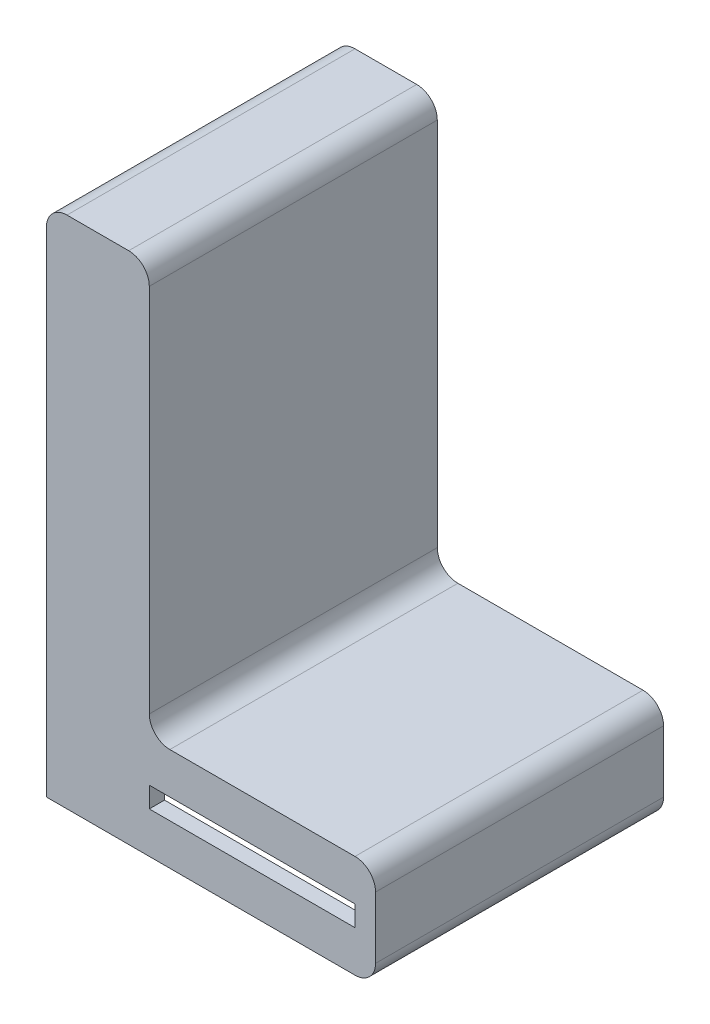
ISO-10303-21;
HEADER;
FILE_DESCRIPTION(('STEP AP214'),'2;1');
FILE_NAME('part.step','',(''),(''),'','','');
FILE_SCHEMA(('AUTOMOTIVE_DESIGN { 1 0 10303 214 1 1 1 1 }'));
ENDSEC;
DATA;
#1=APPLICATION_CONTEXT('core data for automotive mechanical design processes');
#2=APPLICATION_PROTOCOL_DEFINITION('international standard','automotive_design',2000,#1);
#3=PRODUCT_CONTEXT('',#1,'mechanical');
#4=PRODUCT('Part','Part','',(#3));
#5=PRODUCT_RELATED_PRODUCT_CATEGORY('part','',(#4));
#6=PRODUCT_DEFINITION_FORMATION('','',#4);
#7=PRODUCT_DEFINITION_CONTEXT('part definition',#1,'design');
#8=PRODUCT_DEFINITION('design','',#6,#7);
#9=PRODUCT_DEFINITION_SHAPE('','',#8);
#10=(LENGTH_UNIT() NAMED_UNIT(*) SI_UNIT(.MILLI.,.METRE.));
#11=(NAMED_UNIT(*) PLANE_ANGLE_UNIT() SI_UNIT($,.RADIAN.));
#12=(NAMED_UNIT(*) SI_UNIT($,.STERADIAN.) SOLID_ANGLE_UNIT());
#13=UNCERTAINTY_MEASURE_WITH_UNIT(LENGTH_MEASURE(1.E-05),#10,'distance_accuracy_value','');
#14=(GEOMETRIC_REPRESENTATION_CONTEXT(3) GLOBAL_UNCERTAINTY_ASSIGNED_CONTEXT((#13)) GLOBAL_UNIT_ASSIGNED_CONTEXT((#10,
#11,#12)) REPRESENTATION_CONTEXT('',''));
#15=CARTESIAN_POINT('',(0.,0.,0.));
#16=DIRECTION('',(0.,0.,1.));
#17=DIRECTION('',(1.,0.,0.));
#18=AXIS2_PLACEMENT_3D('',#15,#16,#17);
#19=CARTESIAN_POINT('',(0.,0.,14.));
#20=DIRECTION('',(0.,1.,0.));
#21=DIRECTION('',(0.,0.,1.));
#22=AXIS2_PLACEMENT_3D('',#19,#20,#21);
#23=PLANE('',#22);
#24=DIRECTION('',(1.,0.,0.));
#25=VECTOR('',#24,1.);
#26=CARTESIAN_POINT('',(0.683289673684551,0.,0.471103780602268));
#27=LINE('',#26,#25);
#28=CARTESIAN_POINT('',(0.683289673684551,0.,0.471103780602267));
#29=VERTEX_POINT('',#28);
#30=CARTESIAN_POINT('',(14.6647262378319,0.,0.471103780602268));
#31=VERTEX_POINT('',#30);
#32=EDGE_CURVE('E347',#29,#31,#27,.T.);
#33=ORIENTED_EDGE('',*,*,#32,.F.);
#34=DIRECTION('',(0.,0.,-1.));
#35=VECTOR('',#34,1.);
#36=CARTESIAN_POINT('',(0.683289673684551,0.,13.2572361825298));
#37=LINE('',#36,#35);
#38=CARTESIAN_POINT('',(0.683289673684551,0.,13.2572361825298));
#39=VERTEX_POINT('',#38);
#40=EDGE_CURVE('E326',#39,#29,#37,.T.);
#41=ORIENTED_EDGE('',*,*,#40,.F.);
#42=DIRECTION('',(-1.,0.,0.));
#43=VECTOR('',#42,1.);
#44=CARTESIAN_POINT('',(0.683289673684551,0.,13.2572361825298));
#45=LINE('',#44,#43);
#46=CARTESIAN_POINT('',(14.6647262378319,0.,13.2572361825298));
#47=VERTEX_POINT('',#46);
#48=EDGE_CURVE('E332',#47,#39,#45,.T.);
#49=ORIENTED_EDGE('',*,*,#48,.F.);
#50=DIRECTION('',(0.,0.,1.));
#51=VECTOR('',#50,1.);
#52=CARTESIAN_POINT('',(14.6647262378319,0.,13.2572361825298));
#53=LINE('',#52,#51);
#54=EDGE_CURVE('E351',#31,#47,#53,.T.);
#55=ORIENTED_EDGE('',*,*,#54,.F.);
#56=EDGE_LOOP('',(#33,#41,#49,#55));
#57=FACE_BOUND('',#56,.T.);
#58=DIRECTION('',(1.,0.,0.));
#59=VECTOR('',#58,1.);
#60=CARTESIAN_POINT('',(0.,0.,0.));
#61=LINE('',#60,#59);
#62=CARTESIAN_POINT('',(0.,0.,0.));
#63=VERTEX_POINT('',#62);
#64=CARTESIAN_POINT('',(15.,0.,0.));
#65=VERTEX_POINT('',#64);
#66=EDGE_CURVE('E361',#63,#65,#61,.T.);
#67=ORIENTED_EDGE('',*,*,#66,.T.);
#68=DIRECTION('',(0.,0.,-1.));
#69=VECTOR('',#68,1.);
#70=CARTESIAN_POINT('',(15.,0.,14.));
#71=LINE('',#70,#69);
#72=CARTESIAN_POINT('',(15.,0.,14.));
#73=VERTEX_POINT('',#72);
#74=EDGE_CURVE('E482',#73,#65,#71,.T.);
#75=ORIENTED_EDGE('',*,*,#74,.F.);
#76=DIRECTION('',(1.,0.,0.));
#77=VECTOR('',#76,1.);
#78=CARTESIAN_POINT('',(0.,0.,14.));
#79=LINE('',#78,#77);
#80=CARTESIAN_POINT('',(0.,0.,14.));
#81=VERTEX_POINT('',#80);
#82=EDGE_CURVE('E375',#81,#73,#79,.T.);
#83=ORIENTED_EDGE('',*,*,#82,.F.);
#84=DIRECTION('',(0.,0.,-1.));
#85=VECTOR('',#84,1.);
#86=CARTESIAN_POINT('',(0.,0.,14.));
#87=LINE('',#86,#85);
#88=EDGE_CURVE('E410',#81,#63,#87,.T.);
#89=ORIENTED_EDGE('',*,*,#88,.T.);
#90=EDGE_LOOP('',(#67,#75,#83,#89));
#91=FACE_BOUND('',#90,.T.);
#92=ADVANCED_FACE('F45',(#57,#91),#23,.F.);
#93=CARTESIAN_POINT('',(15.,1.,14.));
#94=DIRECTION('',(0.,0.,-1.));
#95=DIRECTION('',(-1.,0.,0.));
#96=AXIS2_PLACEMENT_3D('',#93,#94,#95);
#97=CYLINDRICAL_SURFACE('',#96,1.);
#98=CARTESIAN_POINT('',(15.,1.,0.));
#99=DIRECTION('',(0.,0.,1.));
#100=DIRECTION('',(1.,0.,0.));
#101=AXIS2_PLACEMENT_3D('',#98,#99,#100);
#102=CIRCLE('',#101,1.);
#103=CARTESIAN_POINT('',(16.,1.00000000000001,0.));
#104=VERTEX_POINT('',#103);
#105=EDGE_CURVE('E414',#65,#104,#102,.T.);
#106=ORIENTED_EDGE('',*,*,#105,.T.);
#107=DIRECTION('',(0.,0.,-1.));
#108=VECTOR('',#107,1.);
#109=CARTESIAN_POINT('',(16.,1.00000000000001,14.));
#110=LINE('',#109,#108);
#111=CARTESIAN_POINT('',(16.,1.00000000000001,14.));
#112=VERTEX_POINT('',#111);
#113=EDGE_CURVE('E478',#112,#104,#110,.T.);
#114=ORIENTED_EDGE('',*,*,#113,.F.);
#115=CARTESIAN_POINT('',(15.,1.,14.));
#116=DIRECTION('',(0.,0.,1.));
#117=DIRECTION('',(1.,0.,0.));
#118=AXIS2_PLACEMENT_3D('',#115,#116,#117);
#119=CIRCLE('',#118,1.);
#120=EDGE_CURVE('E379',#73,#112,#119,.T.);
#121=ORIENTED_EDGE('',*,*,#120,.F.);
#122=ORIENTED_EDGE('',*,*,#74,.T.);
#123=EDGE_LOOP('',(#106,#114,#121,#122));
#124=FACE_BOUND('',#123,.T.);
#125=ADVANCED_FACE('F565',(#124),#97,.T.);
#126=CARTESIAN_POINT('',(16.,3.99999999999999,14.));
#127=DIRECTION('',(-1.,0.,0.));
#128=DIRECTION('',(0.,0.,1.));
#129=AXIS2_PLACEMENT_3D('',#126,#127,#128);
#130=PLANE('',#129);
#131=DIRECTION('',(0.,1.,0.));
#132=VECTOR('',#131,1.);
#133=CARTESIAN_POINT('',(16.,3.99999999999999,0.));
#134=LINE('',#133,#132);
#135=CARTESIAN_POINT('',(16.,3.99999999999999,0.));
#136=VERTEX_POINT('',#135);
#137=EDGE_CURVE('E417',#104,#136,#134,.T.);
#138=ORIENTED_EDGE('',*,*,#137,.T.);
#139=DIRECTION('',(0.,0.,-1.));
#140=VECTOR('',#139,1.);
#141=CARTESIAN_POINT('',(16.,3.99999999999999,14.));
#142=LINE('',#141,#140);
#143=CARTESIAN_POINT('',(16.,3.99999999999999,14.));
#144=VERTEX_POINT('',#143);
#145=EDGE_CURVE('E474',#144,#136,#142,.T.);
#146=ORIENTED_EDGE('',*,*,#145,.F.);
#147=DIRECTION('',(0.,1.,0.));
#148=VECTOR('',#147,1.);
#149=CARTESIAN_POINT('',(16.,3.99999999999999,14.));
#150=LINE('',#149,#148);
#151=EDGE_CURVE('E383',#112,#144,#150,.T.);
#152=ORIENTED_EDGE('',*,*,#151,.F.);
#153=ORIENTED_EDGE('',*,*,#113,.T.);
#154=EDGE_LOOP('',(#138,#146,#152,#153));
#155=FACE_BOUND('',#154,.T.);
#156=ADVANCED_FACE('F569',(#155),#130,.F.);
#157=CARTESIAN_POINT('',(15.,4.,14.));
#158=DIRECTION('',(0.,0.,-1.));
#159=DIRECTION('',(-1.,0.,0.));
#160=AXIS2_PLACEMENT_3D('',#157,#158,#159);
#161=CYLINDRICAL_SURFACE('',#160,1.);
#162=CARTESIAN_POINT('',(15.,4.,0.));
#163=DIRECTION('',(0.,0.,1.));
#164=DIRECTION('',(-1.,0.,0.));
#165=AXIS2_PLACEMENT_3D('',#162,#163,#164);
#166=CIRCLE('',#165,1.);
#167=CARTESIAN_POINT('',(15.,5.,0.));
#168=VERTEX_POINT('',#167);
#169=EDGE_CURVE('E420',#136,#168,#166,.T.);
#170=ORIENTED_EDGE('',*,*,#169,.T.);
#171=DIRECTION('',(0.,0.,-1.));
#172=VECTOR('',#171,1.);
#173=CARTESIAN_POINT('',(15.,5.,14.));
#174=LINE('',#173,#172);
#175=CARTESIAN_POINT('',(15.,5.,14.));
#176=VERTEX_POINT('',#175);
#177=EDGE_CURVE('E470',#176,#168,#174,.T.);
#178=ORIENTED_EDGE('',*,*,#177,.F.);
#179=CARTESIAN_POINT('',(15.,4.,14.));
#180=DIRECTION('',(0.,0.,1.));
#181=DIRECTION('',(-1.,0.,0.));
#182=AXIS2_PLACEMENT_3D('',#179,#180,#181);
#183=CIRCLE('',#182,1.);
#184=EDGE_CURVE('E386',#144,#176,#183,.T.);
#185=ORIENTED_EDGE('',*,*,#184,.F.);
#186=ORIENTED_EDGE('',*,*,#145,.T.);
#187=EDGE_LOOP('',(#170,#178,#185,#186));
#188=FACE_BOUND('',#187,.T.);
#189=ADVANCED_FACE('F574',(#188),#161,.T.);
#190=CARTESIAN_POINT('',(6.00000000000001,5.,14.));
#191=DIRECTION('',(0.,-1.,0.));
#192=DIRECTION('',(0.,0.,-1.));
#193=AXIS2_PLACEMENT_3D('',#190,#191,#192);
#194=PLANE('',#193);
#195=DIRECTION('',(-1.,0.,0.));
#196=VECTOR('',#195,1.);
#197=CARTESIAN_POINT('',(6.00000000000001,5.,0.));
#198=LINE('',#197,#196);
#199=CARTESIAN_POINT('',(6.00000000000001,5.,0.));
#200=VERTEX_POINT('',#199);
#201=EDGE_CURVE('E423',#168,#200,#198,.T.);
#202=ORIENTED_EDGE('',*,*,#201,.T.);
#203=DIRECTION('',(0.,0.,-1.));
#204=VECTOR('',#203,1.);
#205=CARTESIAN_POINT('',(6.00000000000001,5.,14.));
#206=LINE('',#205,#204);
#207=CARTESIAN_POINT('',(6.00000000000001,5.,14.));
#208=VERTEX_POINT('',#207);
#209=EDGE_CURVE('E466',#208,#200,#206,.T.);
#210=ORIENTED_EDGE('',*,*,#209,.F.);
#211=DIRECTION('',(-1.,0.,0.));
#212=VECTOR('',#211,1.);
#213=CARTESIAN_POINT('',(6.00000000000001,5.,14.));
#214=LINE('',#213,#212);
#215=EDGE_CURVE('E389',#176,#208,#214,.T.);
#216=ORIENTED_EDGE('',*,*,#215,.F.);
#217=ORIENTED_EDGE('',*,*,#177,.T.);
#218=EDGE_LOOP('',(#202,#210,#216,#217));
#219=FACE_BOUND('',#218,.T.);
#220=ADVANCED_FACE('F580',(#219),#194,.F.);
#221=CARTESIAN_POINT('',(6.,6.,14.));
#222=DIRECTION('',(0.,0.,-1.));
#223=DIRECTION('',(-1.,0.,0.));
#224=AXIS2_PLACEMENT_3D('',#221,#222,#223);
#225=CYLINDRICAL_SURFACE('',#224,1.);
#226=CARTESIAN_POINT('',(6.,6.,0.));
#227=DIRECTION('',(0.,0.,-1.));
#228=DIRECTION('',(1.,0.,0.));
#229=AXIS2_PLACEMENT_3D('',#226,#227,#228);
#230=CIRCLE('',#229,1.);
#231=CARTESIAN_POINT('',(5.,6.00000000000001,0.));
#232=VERTEX_POINT('',#231);
#233=EDGE_CURVE('E426',#200,#232,#230,.T.);
#234=ORIENTED_EDGE('',*,*,#233,.T.);
#235=DIRECTION('',(0.,0.,-1.));
#236=VECTOR('',#235,1.);
#237=CARTESIAN_POINT('',(5.,6.00000000000001,14.));
#238=LINE('',#237,#236);
#239=CARTESIAN_POINT('',(5.,6.00000000000001,14.));
#240=VERTEX_POINT('',#239);
#241=EDGE_CURVE('E462',#240,#232,#238,.T.);
#242=ORIENTED_EDGE('',*,*,#241,.F.);
#243=CARTESIAN_POINT('',(6.,6.,14.));
#244=DIRECTION('',(0.,0.,-1.));
#245=DIRECTION('',(1.,0.,0.));
#246=AXIS2_PLACEMENT_3D('',#243,#244,#245);
#247=CIRCLE('',#246,1.);
#248=EDGE_CURVE('E392',#208,#240,#247,.T.);
#249=ORIENTED_EDGE('',*,*,#248,.F.);
#250=ORIENTED_EDGE('',*,*,#209,.T.);
#251=EDGE_LOOP('',(#234,#242,#249,#250));
#252=FACE_BOUND('',#251,.T.);
#253=ADVANCED_FACE('F584',(#252),#225,.F.);
#254=CARTESIAN_POINT('',(5.,24.,14.));
#255=DIRECTION('',(-1.,0.,0.));
#256=DIRECTION('',(0.,0.,1.));
#257=AXIS2_PLACEMENT_3D('',#254,#255,#256);
#258=PLANE('',#257);
#259=DIRECTION('',(0.,1.,0.));
#260=VECTOR('',#259,1.);
#261=CARTESIAN_POINT('',(5.,24.,0.));
#262=LINE('',#261,#260);
#263=CARTESIAN_POINT('',(5.,24.,0.));
#264=VERTEX_POINT('',#263);
#265=EDGE_CURVE('E429',#232,#264,#262,.T.);
#266=ORIENTED_EDGE('',*,*,#265,.T.);
#267=DIRECTION('',(0.,0.,-1.));
#268=VECTOR('',#267,1.);
#269=CARTESIAN_POINT('',(5.,24.,14.));
#270=LINE('',#269,#268);
#271=CARTESIAN_POINT('',(5.,24.,14.));
#272=VERTEX_POINT('',#271);
#273=EDGE_CURVE('E458',#272,#264,#270,.T.);
#274=ORIENTED_EDGE('',*,*,#273,.F.);
#275=DIRECTION('',(0.,1.,0.));
#276=VECTOR('',#275,1.);
#277=CARTESIAN_POINT('',(5.,24.,14.));
#278=LINE('',#277,#276);
#279=EDGE_CURVE('E395',#240,#272,#278,.T.);
#280=ORIENTED_EDGE('',*,*,#279,.F.);
#281=ORIENTED_EDGE('',*,*,#241,.T.);
#282=EDGE_LOOP('',(#266,#274,#280,#281));
#283=FACE_BOUND('',#282,.T.);
#284=ADVANCED_FACE('F588',(#283),#258,.F.);
#285=CARTESIAN_POINT('',(4.,24.,14.));
#286=DIRECTION('',(0.,0.,-1.));
#287=DIRECTION('',(-1.,0.,0.));
#288=AXIS2_PLACEMENT_3D('',#285,#286,#287);
#289=CYLINDRICAL_SURFACE('',#288,1.);
#290=CARTESIAN_POINT('',(4.,24.,0.));
#291=DIRECTION('',(0.,0.,1.));
#292=DIRECTION('',(1.,0.,0.));
#293=AXIS2_PLACEMENT_3D('',#290,#291,#292);
#294=CIRCLE('',#293,1.);
#295=CARTESIAN_POINT('',(3.99999999999999,25.,0.));
#296=VERTEX_POINT('',#295);
#297=EDGE_CURVE('E432',#264,#296,#294,.T.);
#298=ORIENTED_EDGE('',*,*,#297,.T.);
#299=DIRECTION('',(0.,0.,-1.));
#300=VECTOR('',#299,1.);
#301=CARTESIAN_POINT('',(3.99999999999999,25.,14.));
#302=LINE('',#301,#300);
#303=CARTESIAN_POINT('',(3.99999999999999,25.,14.));
#304=VERTEX_POINT('',#303);
#305=EDGE_CURVE('E454',#304,#296,#302,.T.);
#306=ORIENTED_EDGE('',*,*,#305,.F.);
#307=CARTESIAN_POINT('',(4.,24.,14.));
#308=DIRECTION('',(0.,0.,1.));
#309=DIRECTION('',(1.,0.,0.));
#310=AXIS2_PLACEMENT_3D('',#307,#308,#309);
#311=CIRCLE('',#310,1.);
#312=EDGE_CURVE('E398',#272,#304,#311,.T.);
#313=ORIENTED_EDGE('',*,*,#312,.F.);
#314=ORIENTED_EDGE('',*,*,#273,.T.);
#315=EDGE_LOOP('',(#298,#306,#313,#314));
#316=FACE_BOUND('',#315,.T.);
#317=ADVANCED_FACE('F592',(#316),#289,.T.);
#318=CARTESIAN_POINT('',(1.00000000000001,25.,14.));
#319=DIRECTION('',(0.,-1.,0.));
#320=DIRECTION('',(0.,0.,-1.));
#321=AXIS2_PLACEMENT_3D('',#318,#319,#320);
#322=PLANE('',#321);
#323=DIRECTION('',(-1.,0.,0.));
#324=VECTOR('',#323,1.);
#325=CARTESIAN_POINT('',(1.00000000000001,25.,0.));
#326=LINE('',#325,#324);
#327=CARTESIAN_POINT('',(1.00000000000001,25.,0.));
#328=VERTEX_POINT('',#327);
#329=EDGE_CURVE('E435',#296,#328,#326,.T.);
#330=ORIENTED_EDGE('',*,*,#329,.T.);
#331=DIRECTION('',(0.,0.,-1.));
#332=VECTOR('',#331,1.);
#333=CARTESIAN_POINT('',(1.00000000000001,25.,14.));
#334=LINE('',#333,#332);
#335=CARTESIAN_POINT('',(1.00000000000001,25.,14.));
#336=VERTEX_POINT('',#335);
#337=EDGE_CURVE('E450',#336,#328,#334,.T.);
#338=ORIENTED_EDGE('',*,*,#337,.F.);
#339=DIRECTION('',(-1.,0.,0.));
#340=VECTOR('',#339,1.);
#341=CARTESIAN_POINT('',(1.00000000000001,25.,14.));
#342=LINE('',#341,#340);
#343=EDGE_CURVE('E401',#304,#336,#342,.T.);
#344=ORIENTED_EDGE('',*,*,#343,.F.);
#345=ORIENTED_EDGE('',*,*,#305,.T.);
#346=EDGE_LOOP('',(#330,#338,#344,#345));
#347=FACE_BOUND('',#346,.T.);
#348=ADVANCED_FACE('F596',(#347),#322,.F.);
#349=CARTESIAN_POINT('',(1.,24.,14.));
#350=DIRECTION('',(0.,0.,-1.));
#351=DIRECTION('',(-1.,0.,0.));
#352=AXIS2_PLACEMENT_3D('',#349,#350,#351);
#353=CYLINDRICAL_SURFACE('',#352,1.);
#354=CARTESIAN_POINT('',(1.,24.,0.));
#355=DIRECTION('',(0.,0.,1.));
#356=DIRECTION('',(-1.,0.,0.));
#357=AXIS2_PLACEMENT_3D('',#354,#355,#356);
#358=CIRCLE('',#357,1.);
#359=CARTESIAN_POINT('',(0.,24.,0.));
#360=VERTEX_POINT('',#359);
#361=EDGE_CURVE('E438',#328,#360,#358,.T.);
#362=ORIENTED_EDGE('',*,*,#361,.T.);
#363=DIRECTION('',(0.,0.,-1.));
#364=VECTOR('',#363,1.);
#365=CARTESIAN_POINT('',(0.,24.,14.));
#366=LINE('',#365,#364);
#367=CARTESIAN_POINT('',(0.,24.,14.));
#368=VERTEX_POINT('',#367);
#369=EDGE_CURVE('E446',#368,#360,#366,.T.);
#370=ORIENTED_EDGE('',*,*,#369,.F.);
#371=CARTESIAN_POINT('',(1.,24.,14.));
#372=DIRECTION('',(0.,0.,1.));
#373=DIRECTION('',(-1.,0.,0.));
#374=AXIS2_PLACEMENT_3D('',#371,#372,#373);
#375=CIRCLE('',#374,1.);
#376=EDGE_CURVE('E404',#336,#368,#375,.T.);
#377=ORIENTED_EDGE('',*,*,#376,.F.);
#378=ORIENTED_EDGE('',*,*,#337,.T.);
#379=EDGE_LOOP('',(#362,#370,#377,#378));
#380=FACE_BOUND('',#379,.T.);
#381=ADVANCED_FACE('F600',(#380),#353,.T.);
#382=CARTESIAN_POINT('',(0.,24.,14.));
#383=DIRECTION('',(1.,0.,0.));
#384=DIRECTION('',(0.,1.,0.));
#385=AXIS2_PLACEMENT_3D('',#382,#383,#384);
#386=PLANE('',#385);
#387=DIRECTION('',(0.,-1.,0.));
#388=VECTOR('',#387,1.);
#389=CARTESIAN_POINT('',(0.,24.,0.));
#390=LINE('',#389,#388);
#391=EDGE_CURVE('E380',#360,#63,#390,.T.);
#392=ORIENTED_EDGE('',*,*,#391,.T.);
#393=ORIENTED_EDGE('',*,*,#88,.F.);
#394=DIRECTION('',(0.,-1.,0.));
#395=VECTOR('',#394,1.);
#396=CARTESIAN_POINT('',(0.,24.,14.));
#397=LINE('',#396,#395);
#398=EDGE_CURVE('E407',#368,#81,#397,.T.);
#399=ORIENTED_EDGE('',*,*,#398,.F.);
#400=ORIENTED_EDGE('',*,*,#369,.T.);
#401=EDGE_LOOP('',(#392,#393,#399,#400));
#402=FACE_BOUND('',#401,.T.);
#403=ADVANCED_FACE('F604',(#402),#386,.F.);
#404=CARTESIAN_POINT('',(15.,1.,14.));
#405=DIRECTION('',(0.,0.,1.));
#406=DIRECTION('',(1.,0.,0.));
#407=AXIS2_PLACEMENT_3D('',#404,#405,#406);
#408=PLANE('',#407);
#409=DIRECTION('',(0.,-1.,0.));
#410=VECTOR('',#409,1.);
#411=CARTESIAN_POINT('',(5.,3.,14.));
#412=LINE('',#411,#410);
#413=CARTESIAN_POINT('',(5.,3.,14.));
#414=VERTEX_POINT('',#413);
#415=CARTESIAN_POINT('',(5.,2.,14.));
#416=VERTEX_POINT('',#415);
#417=EDGE_CURVE('E68',#414,#416,#412,.T.);
#418=ORIENTED_EDGE('',*,*,#417,.F.);
#419=DIRECTION('',(-1.,0.,0.));
#420=VECTOR('',#419,1.);
#421=CARTESIAN_POINT('',(5.,3.,14.));
#422=LINE('',#421,#420);
#423=CARTESIAN_POINT('',(15.,3.,14.));
#424=VERTEX_POINT('',#423);
#425=EDGE_CURVE('E286',#424,#414,#422,.T.);
#426=ORIENTED_EDGE('',*,*,#425,.F.);
#427=DIRECTION('',(0.,1.,0.));
#428=VECTOR('',#427,1.);
#429=CARTESIAN_POINT('',(15.,3.,14.));
#430=LINE('',#429,#428);
#431=CARTESIAN_POINT('',(15.,2.,14.));
#432=VERTEX_POINT('',#431);
#433=EDGE_CURVE('E300',#432,#424,#430,.T.);
#434=ORIENTED_EDGE('',*,*,#433,.F.);
#435=DIRECTION('',(1.,0.,0.));
#436=VECTOR('',#435,1.);
#437=CARTESIAN_POINT('',(5.,2.,14.));
#438=LINE('',#437,#436);
#439=EDGE_CURVE('E296',#416,#432,#438,.T.);
#440=ORIENTED_EDGE('',*,*,#439,.F.);
#441=EDGE_LOOP('',(#418,#426,#434,#440));
#442=FACE_BOUND('',#441,.T.);
#443=ORIENTED_EDGE('',*,*,#82,.T.);
#444=ORIENTED_EDGE('',*,*,#120,.T.);
#445=ORIENTED_EDGE('',*,*,#151,.T.);
#446=ORIENTED_EDGE('',*,*,#184,.T.);
#447=ORIENTED_EDGE('',*,*,#215,.T.);
#448=ORIENTED_EDGE('',*,*,#248,.T.);
#449=ORIENTED_EDGE('',*,*,#279,.T.);
#450=ORIENTED_EDGE('',*,*,#312,.T.);
#451=ORIENTED_EDGE('',*,*,#343,.T.);
#452=ORIENTED_EDGE('',*,*,#376,.T.);
#453=ORIENTED_EDGE('',*,*,#398,.T.);
#454=EDGE_LOOP('',(#443,#444,#445,#446,#447,#448,#449,#450,#451,#452,#453));
#455=FACE_BOUND('',#454,.T.);
#456=ADVANCED_FACE('F560',(#442,#455),#408,.T.);
#457=CARTESIAN_POINT('',(15.,1.,0.));
#458=DIRECTION('',(0.,0.,1.));
#459=DIRECTION('',(1.,0.,0.));
#460=AXIS2_PLACEMENT_3D('',#457,#458,#459);
#461=PLANE('',#460);
#462=DIRECTION('',(1.,0.,0.));
#463=VECTOR('',#462,1.);
#464=CARTESIAN_POINT('',(15.,3.,0.));
#465=LINE('',#464,#463);
#466=CARTESIAN_POINT('',(5.05701626726173,3.,0.));
#467=VERTEX_POINT('',#466);
#468=CARTESIAN_POINT('',(15.,3.,0.));
#469=VERTEX_POINT('',#468);
#470=EDGE_CURVE('E234',#467,#469,#465,.T.);
#471=ORIENTED_EDGE('',*,*,#470,.F.);
#472=DIRECTION('',(0.,1.,0.));
#473=VECTOR('',#472,1.);
#474=CARTESIAN_POINT('',(5.05701626726173,3.,0.));
#475=LINE('',#474,#473);
#476=CARTESIAN_POINT('',(5.05701626726173,2.,0.));
#477=VERTEX_POINT('',#476);
#478=EDGE_CURVE('E241',#477,#467,#475,.T.);
#479=ORIENTED_EDGE('',*,*,#478,.F.);
#480=DIRECTION('',(-1.,0.,0.));
#481=VECTOR('',#480,1.);
#482=CARTESIAN_POINT('',(15.,2.,0.));
#483=LINE('',#482,#481);
#484=CARTESIAN_POINT('',(15.,2.,0.));
#485=VERTEX_POINT('',#484);
#486=EDGE_CURVE('E225',#485,#477,#483,.T.);
#487=ORIENTED_EDGE('',*,*,#486,.F.);
#488=DIRECTION('',(0.,-1.,0.));
#489=VECTOR('',#488,1.);
#490=CARTESIAN_POINT('',(15.,3.,0.));
#491=LINE('',#490,#489);
#492=EDGE_CURVE('E60',#469,#485,#491,.T.);
#493=ORIENTED_EDGE('',*,*,#492,.F.);
#494=EDGE_LOOP('',(#471,#479,#487,#493));
#495=FACE_BOUND('',#494,.T.);
#496=ORIENTED_EDGE('',*,*,#66,.F.);
#497=ORIENTED_EDGE('',*,*,#391,.F.);
#498=ORIENTED_EDGE('',*,*,#361,.F.);
#499=ORIENTED_EDGE('',*,*,#329,.F.);
#500=ORIENTED_EDGE('',*,*,#297,.F.);
#501=ORIENTED_EDGE('',*,*,#265,.F.);
#502=ORIENTED_EDGE('',*,*,#233,.F.);
#503=ORIENTED_EDGE('',*,*,#201,.F.);
#504=ORIENTED_EDGE('',*,*,#169,.F.);
#505=ORIENTED_EDGE('',*,*,#137,.F.);
#506=ORIENTED_EDGE('',*,*,#105,.F.);
#507=EDGE_LOOP('',(#496,#497,#498,#499,#500,#501,#502,#503,#504,#505,#506));
#508=FACE_BOUND('',#507,.T.);
#509=ADVANCED_FACE('F245',(#495,#508),#461,.F.);
#510=CARTESIAN_POINT('',(0.683289673684551,4.,13.2572361825298));
#511=DIRECTION('',(-1.,0.,0.));
#512=DIRECTION('',(0.,0.,1.));
#513=AXIS2_PLACEMENT_3D('',#510,#511,#512);
#514=PLANE('',#513);
#515=ORIENTED_EDGE('',*,*,#40,.T.);
#516=DIRECTION('',(0.,-1.,0.));
#517=VECTOR('',#516,1.);
#518=CARTESIAN_POINT('',(0.683289673684551,4.,0.471103780602268));
#519=LINE('',#518,#517);
#520=CARTESIAN_POINT('',(0.683289673684551,4.,0.471103780602268));
#521=VERTEX_POINT('',#520);
#522=EDGE_CURVE('E344',#521,#29,#519,.T.);
#523=ORIENTED_EDGE('',*,*,#522,.F.);
#524=DIRECTION('',(0.,0.,-1.));
#525=VECTOR('',#524,1.);
#526=CARTESIAN_POINT('',(0.683289673684551,4.,13.2572361825298));
#527=LINE('',#526,#525);
#528=CARTESIAN_POINT('',(0.683289673684551,4.,13.2572361825298));
#529=VERTEX_POINT('',#528);
#530=EDGE_CURVE('E327',#529,#521,#527,.T.);
#531=ORIENTED_EDGE('',*,*,#530,.F.);
#532=DIRECTION('',(0.,-1.,0.));
#533=VECTOR('',#532,1.);
#534=CARTESIAN_POINT('',(0.683289673684551,4.,13.2572361825298));
#535=LINE('',#534,#533);
#536=EDGE_CURVE('E358',#529,#39,#535,.T.);
#537=ORIENTED_EDGE('',*,*,#536,.T.);
#538=EDGE_LOOP('',(#515,#523,#531,#537));
#539=FACE_BOUND('',#538,.T.);
#540=ADVANCED_FACE('F552',(#539),#514,.F.);
#541=CARTESIAN_POINT('',(0.683289673684551,4.,13.2572361825298));
#542=DIRECTION('',(0.,0.,1.));
#543=DIRECTION('',(1.,0.,0.));
#544=AXIS2_PLACEMENT_3D('',#541,#542,#543);
#545=PLANE('',#544);
#546=DIRECTION('',(0.,-1.,0.));
#547=VECTOR('',#546,1.);
#548=CARTESIAN_POINT('',(14.6647262378319,4.,13.2572361825298));
#549=LINE('',#548,#547);
#550=CARTESIAN_POINT('',(14.6647262378319,4.,13.2572361825298));
#551=VERTEX_POINT('',#550);
#552=CARTESIAN_POINT('',(14.6647262378319,3.,13.2572361825298));
#553=VERTEX_POINT('',#552);
#554=EDGE_CURVE('E362',#551,#553,#549,.T.);
#555=ORIENTED_EDGE('',*,*,#554,.T.);
#556=DIRECTION('',(-1.,0.,0.));
#557=VECTOR('',#556,1.);
#558=CARTESIAN_POINT('',(0.683289673684551,3.,13.2572361825298));
#559=LINE('',#558,#557);
#560=CARTESIAN_POINT('',(5.,3.,13.2572361825298));
#561=VERTEX_POINT('',#560);
#562=EDGE_CURVE('E322',#553,#561,#559,.T.);
#563=ORIENTED_EDGE('',*,*,#562,.T.);
#564=DIRECTION('',(0.,-1.,0.));
#565=VECTOR('',#564,1.);
#566=CARTESIAN_POINT('',(5.,4.,13.2572361825298));
#567=LINE('',#566,#565);
#568=CARTESIAN_POINT('',(5.,2.,13.2572361825298));
#569=VERTEX_POINT('',#568);
#570=EDGE_CURVE('E497',#561,#569,#567,.T.);
#571=ORIENTED_EDGE('',*,*,#570,.T.);
#572=DIRECTION('',(1.,0.,0.));
#573=VECTOR('',#572,1.);
#574=CARTESIAN_POINT('',(0.683289673684551,2.,13.2572361825298));
#575=LINE('',#574,#573);
#576=CARTESIAN_POINT('',(14.6647262378319,2.,13.2572361825298));
#577=VERTEX_POINT('',#576);
#578=EDGE_CURVE('E310',#569,#577,#575,.T.);
#579=ORIENTED_EDGE('',*,*,#578,.T.);
#580=EDGE_CURVE('E366',#577,#47,#549,.T.);
#581=ORIENTED_EDGE('',*,*,#580,.T.);
#582=ORIENTED_EDGE('',*,*,#48,.T.);
#583=ORIENTED_EDGE('',*,*,#536,.F.);
#584=DIRECTION('',(-1.,0.,0.));
#585=VECTOR('',#584,1.);
#586=CARTESIAN_POINT('',(0.683289673684551,4.,13.2572361825298));
#587=LINE('',#586,#585);
#588=EDGE_CURVE('E340',#551,#529,#587,.T.);
#589=ORIENTED_EDGE('',*,*,#588,.F.);
#590=EDGE_LOOP('',(#555,#563,#571,#579,#581,#582,#583,#589));
#591=FACE_BOUND('',#590,.T.);
#592=ADVANCED_FACE('F532',(#591),#545,.F.);
#593=CARTESIAN_POINT('',(14.6647262378319,4.,13.2572361825298));
#594=DIRECTION('',(1.,0.,0.));
#595=DIRECTION('',(0.,0.,-1.));
#596=AXIS2_PLACEMENT_3D('',#593,#594,#595);
#597=PLANE('',#596);
#598=DIRECTION('',(0.,-1.,0.));
#599=VECTOR('',#598,1.);
#600=CARTESIAN_POINT('',(14.6647262378319,4.,0.471103780602268));
#601=LINE('',#600,#599);
#602=CARTESIAN_POINT('',(14.6647262378319,4.,0.471103780602268));
#603=VERTEX_POINT('',#602);
#604=CARTESIAN_POINT('',(14.6647262378319,3.,0.471103780602268));
#605=VERTEX_POINT('',#604);
#606=EDGE_CURVE('E367',#603,#605,#601,.T.);
#607=ORIENTED_EDGE('',*,*,#606,.T.);
#608=DIRECTION('',(0.,0.,1.));
#609=VECTOR('',#608,1.);
#610=CARTESIAN_POINT('',(14.6647262378319,3.,13.2572361825298));
#611=LINE('',#610,#609);
#612=CARTESIAN_POINT('',(14.6647262378319,3.,4.));
#613=VERTEX_POINT('',#612);
#614=EDGE_CURVE('E278',#605,#613,#611,.T.);
#615=ORIENTED_EDGE('',*,*,#614,.T.);
#616=DIRECTION('',(0.,1.,0.));
#617=VECTOR('',#616,1.);
#618=CARTESIAN_POINT('',(14.6647262378319,4.,4.));
#619=LINE('',#618,#617);
#620=CARTESIAN_POINT('',(14.6647262378319,2.,4.));
#621=VERTEX_POINT('',#620);
#622=EDGE_CURVE('E53',#621,#613,#619,.T.);
#623=ORIENTED_EDGE('',*,*,#622,.F.);
#624=DIRECTION('',(0.,0.,-1.));
#625=VECTOR('',#624,1.);
#626=CARTESIAN_POINT('',(14.6647262378319,2.,13.2572361825298));
#627=LINE('',#626,#625);
#628=CARTESIAN_POINT('',(14.6647262378319,2.,0.471103780602268));
#629=VERTEX_POINT('',#628);
#630=EDGE_CURVE('E272',#621,#629,#627,.T.);
#631=ORIENTED_EDGE('',*,*,#630,.T.);
#632=EDGE_CURVE('E371',#629,#31,#601,.T.);
#633=ORIENTED_EDGE('',*,*,#632,.T.);
#634=ORIENTED_EDGE('',*,*,#54,.T.);
#635=ORIENTED_EDGE('',*,*,#580,.F.);
#636=DIRECTION('',(0.,0.,-1.));
#637=VECTOR('',#636,1.);
#638=CARTESIAN_POINT('',(14.6647262378319,2.,13.2572361825298));
#639=LINE('',#638,#637);
#640=CARTESIAN_POINT('',(14.6647262378319,2.,10.));
#641=VERTEX_POINT('',#640);
#642=EDGE_CURVE('E489',#577,#641,#639,.T.);
#643=ORIENTED_EDGE('',*,*,#642,.T.);
#644=DIRECTION('',(0.,-1.,0.));
#645=VECTOR('',#644,1.);
#646=CARTESIAN_POINT('',(14.6647262378319,4.,10.));
#647=LINE('',#646,#645);
#648=CARTESIAN_POINT('',(14.6647262378319,3.,10.));
#649=VERTEX_POINT('',#648);
#650=EDGE_CURVE('E486',#649,#641,#647,.T.);
#651=ORIENTED_EDGE('',*,*,#650,.F.);
#652=DIRECTION('',(0.,0.,1.));
#653=VECTOR('',#652,1.);
#654=CARTESIAN_POINT('',(14.6647262378319,3.,13.2572361825298));
#655=LINE('',#654,#653);
#656=EDGE_CURVE('E493',#649,#553,#655,.T.);
#657=ORIENTED_EDGE('',*,*,#656,.T.);
#658=ORIENTED_EDGE('',*,*,#554,.F.);
#659=DIRECTION('',(0.,0.,1.));
#660=VECTOR('',#659,1.);
#661=CARTESIAN_POINT('',(14.6647262378319,4.,13.2572361825298));
#662=LINE('',#661,#660);
#663=EDGE_CURVE('E336',#603,#551,#662,.T.);
#664=ORIENTED_EDGE('',*,*,#663,.F.);
#665=EDGE_LOOP('',(#607,#615,#623,#631,#633,#634,#635,#643,#651,#657,#658,#664));
#666=FACE_BOUND('',#665,.T.);
#667=ADVANCED_FACE('F517',(#666),#597,.F.);
#668=CARTESIAN_POINT('',(0.683289673684551,4.,0.471103780602268));
#669=DIRECTION('',(0.,0.,-1.));
#670=DIRECTION('',(-1.,0.,0.));
#671=AXIS2_PLACEMENT_3D('',#668,#669,#670);
#672=PLANE('',#671);
#673=DIRECTION('',(0.,1.,0.));
#674=VECTOR('',#673,1.);
#675=CARTESIAN_POINT('',(5.05701626726173,4.,0.471103780602268));
#676=LINE('',#675,#674);
#677=CARTESIAN_POINT('',(5.05701626726173,2.,0.471103780602268));
#678=VERTEX_POINT('',#677);
#679=CARTESIAN_POINT('',(5.05701626726173,3.,0.471103780602268));
#680=VERTEX_POINT('',#679);
#681=EDGE_CURVE('E11',#678,#680,#676,.T.);
#682=ORIENTED_EDGE('',*,*,#681,.T.);
#683=DIRECTION('',(1.,0.,0.));
#684=VECTOR('',#683,1.);
#685=CARTESIAN_POINT('',(0.683289673684551,3.,0.471103780602268));
#686=LINE('',#685,#684);
#687=EDGE_CURVE('E504',#680,#605,#686,.T.);
#688=ORIENTED_EDGE('',*,*,#687,.T.);
#689=ORIENTED_EDGE('',*,*,#606,.F.);
#690=DIRECTION('',(1.,0.,0.));
#691=VECTOR('',#690,1.);
#692=CARTESIAN_POINT('',(0.683289673684551,4.,0.471103780602268));
#693=LINE('',#692,#691);
#694=EDGE_CURVE('E331',#521,#603,#693,.T.);
#695=ORIENTED_EDGE('',*,*,#694,.F.);
#696=ORIENTED_EDGE('',*,*,#522,.T.);
#697=ORIENTED_EDGE('',*,*,#32,.T.);
#698=ORIENTED_EDGE('',*,*,#632,.F.);
#699=DIRECTION('',(-1.,0.,0.));
#700=VECTOR('',#699,1.);
#701=CARTESIAN_POINT('',(0.683289673684551,2.,0.471103780602268));
#702=LINE('',#701,#700);
#703=EDGE_CURVE('E501',#629,#678,#702,.T.);
#704=ORIENTED_EDGE('',*,*,#703,.T.);
#705=EDGE_LOOP('',(#682,#688,#689,#695,#696,#697,#698,#704));
#706=FACE_BOUND('',#705,.T.);
#707=ADVANCED_FACE('F521',(#706),#672,.F.);
#708=CARTESIAN_POINT('',(0.,4.,0.));
#709=DIRECTION('',(0.,-1.,0.));
#710=DIRECTION('',(0.,0.,-1.));
#711=AXIS2_PLACEMENT_3D('',#708,#709,#710);
#712=PLANE('',#711);
#713=ORIENTED_EDGE('',*,*,#530,.T.);
#714=ORIENTED_EDGE('',*,*,#694,.T.);
#715=ORIENTED_EDGE('',*,*,#663,.T.);
#716=ORIENTED_EDGE('',*,*,#588,.T.);
#717=EDGE_LOOP('',(#713,#714,#715,#716));
#718=FACE_BOUND('',#717,.T.);
#719=ADVANCED_FACE('F550',(#718),#712,.T.);
#720=CARTESIAN_POINT('',(5.,3.,10.));
#721=DIRECTION('',(-1.,0.,0.));
#722=DIRECTION('',(0.,0.,1.));
#723=AXIS2_PLACEMENT_3D('',#720,#721,#722);
#724=PLANE('',#723);
#725=DIRECTION('',(0.,0.,1.));
#726=VECTOR('',#725,1.);
#727=CARTESIAN_POINT('',(5.,3.,10.));
#728=LINE('',#727,#726);
#729=EDGE_CURVE('E307',#561,#414,#728,.T.);
#730=ORIENTED_EDGE('',*,*,#729,.T.);
#731=ORIENTED_EDGE('',*,*,#417,.T.);
#732=DIRECTION('',(0.,0.,1.));
#733=VECTOR('',#732,1.);
#734=CARTESIAN_POINT('',(5.,2.,10.));
#735=LINE('',#734,#733);
#736=EDGE_CURVE('E293',#569,#416,#735,.T.);
#737=ORIENTED_EDGE('',*,*,#736,.F.);
#738=ORIENTED_EDGE('',*,*,#570,.F.);
#739=EDGE_LOOP('',(#730,#731,#737,#738));
#740=FACE_BOUND('',#739,.T.);
#741=ADVANCED_FACE('F647',(#740),#724,.F.);
#742=CARTESIAN_POINT('',(5.,3.,10.));
#743=DIRECTION('',(0.,1.,0.));
#744=DIRECTION('',(0.,0.,1.));
#745=AXIS2_PLACEMENT_3D('',#742,#743,#744);
#746=PLANE('',#745);
#747=ORIENTED_EDGE('',*,*,#656,.F.);
#748=DIRECTION('',(-1.,0.,0.));
#749=VECTOR('',#748,1.);
#750=CARTESIAN_POINT('',(5.,3.,10.));
#751=LINE('',#750,#749);
#752=CARTESIAN_POINT('',(15.,3.,10.));
#753=VERTEX_POINT('',#752);
#754=EDGE_CURVE('E290',#753,#649,#751,.T.);
#755=ORIENTED_EDGE('',*,*,#754,.F.);
#756=DIRECTION('',(0.,0.,1.));
#757=VECTOR('',#756,1.);
#758=CARTESIAN_POINT('',(15.,3.,10.));
#759=LINE('',#758,#757);
#760=EDGE_CURVE('E311',#753,#424,#759,.T.);
#761=ORIENTED_EDGE('',*,*,#760,.T.);
#762=ORIENTED_EDGE('',*,*,#425,.T.);
#763=ORIENTED_EDGE('',*,*,#729,.F.);
#764=ORIENTED_EDGE('',*,*,#562,.F.);
#765=EDGE_LOOP('',(#747,#755,#761,#762,#763,#764));
#766=FACE_BOUND('',#765,.T.);
#767=ADVANCED_FACE('F547',(#766),#746,.F.);
#768=CARTESIAN_POINT('',(5.,2.,10.));
#769=DIRECTION('',(0.,-1.,0.));
#770=DIRECTION('',(0.,0.,-1.));
#771=AXIS2_PLACEMENT_3D('',#768,#769,#770);
#772=PLANE('',#771);
#773=ORIENTED_EDGE('',*,*,#736,.T.);
#774=ORIENTED_EDGE('',*,*,#439,.T.);
#775=DIRECTION('',(0.,0.,1.));
#776=VECTOR('',#775,1.);
#777=CARTESIAN_POINT('',(15.,2.,10.));
#778=LINE('',#777,#776);
#779=CARTESIAN_POINT('',(15.,2.,10.));
#780=VERTEX_POINT('',#779);
#781=EDGE_CURVE('E314',#780,#432,#778,.T.);
#782=ORIENTED_EDGE('',*,*,#781,.F.);
#783=DIRECTION('',(1.,0.,0.));
#784=VECTOR('',#783,1.);
#785=CARTESIAN_POINT('',(5.,2.,10.));
#786=LINE('',#785,#784);
#787=EDGE_CURVE('E282',#641,#780,#786,.T.);
#788=ORIENTED_EDGE('',*,*,#787,.F.);
#789=ORIENTED_EDGE('',*,*,#642,.F.);
#790=ORIENTED_EDGE('',*,*,#578,.F.);
#791=EDGE_LOOP('',(#773,#774,#782,#788,#789,#790));
#792=FACE_BOUND('',#791,.T.);
#793=ADVANCED_FACE('F539',(#792),#772,.F.);
#794=CARTESIAN_POINT('',(0.,0.,10.));
#795=DIRECTION('',(0.,0.,1.));
#796=DIRECTION('',(1.,0.,0.));
#797=AXIS2_PLACEMENT_3D('',#794,#795,#796);
#798=PLANE('',#797);
#799=ORIENTED_EDGE('',*,*,#650,.T.);
#800=ORIENTED_EDGE('',*,*,#787,.T.);
#801=DIRECTION('',(0.,1.,0.));
#802=VECTOR('',#801,1.);
#803=CARTESIAN_POINT('',(15.,3.,10.));
#804=LINE('',#803,#802);
#805=EDGE_CURVE('E285',#780,#753,#804,.T.);
#806=ORIENTED_EDGE('',*,*,#805,.T.);
#807=ORIENTED_EDGE('',*,*,#754,.T.);
#808=EDGE_LOOP('',(#799,#800,#806,#807));
#809=FACE_BOUND('',#808,.T.);
#810=ADVANCED_FACE('F543',(#809),#798,.T.);
#811=CARTESIAN_POINT('',(15.,3.,10.));
#812=DIRECTION('',(1.,0.,0.));
#813=DIRECTION('',(0.,0.,-1.));
#814=AXIS2_PLACEMENT_3D('',#811,#812,#813);
#815=PLANE('',#814);
#816=ORIENTED_EDGE('',*,*,#433,.T.);
#817=ORIENTED_EDGE('',*,*,#760,.F.);
#818=ORIENTED_EDGE('',*,*,#805,.F.);
#819=ORIENTED_EDGE('',*,*,#781,.T.);
#820=EDGE_LOOP('',(#816,#817,#818,#819));
#821=FACE_BOUND('',#820,.T.);
#822=ADVANCED_FACE('F649',(#821),#815,.F.);
#823=CARTESIAN_POINT('',(0.,0.,4.));
#824=DIRECTION('',(0.,0.,-1.));
#825=DIRECTION('',(-1.,0.,0.));
#826=AXIS2_PLACEMENT_3D('',#823,#824,#825);
#827=PLANE('',#826);
#828=ORIENTED_EDGE('',*,*,#622,.T.);
#829=DIRECTION('',(1.,0.,0.));
#830=VECTOR('',#829,1.);
#831=CARTESIAN_POINT('',(15.,3.,4.));
#832=LINE('',#831,#830);
#833=CARTESIAN_POINT('',(15.,3.,4.));
#834=VERTEX_POINT('',#833);
#835=EDGE_CURVE('E262',#613,#834,#832,.T.);
#836=ORIENTED_EDGE('',*,*,#835,.T.);
#837=DIRECTION('',(0.,-1.,0.));
#838=VECTOR('',#837,1.);
#839=CARTESIAN_POINT('',(15.,3.,4.));
#840=LINE('',#839,#838);
#841=CARTESIAN_POINT('',(15.,2.,4.));
#842=VERTEX_POINT('',#841);
#843=EDGE_CURVE('E254',#834,#842,#840,.T.);
#844=ORIENTED_EDGE('',*,*,#843,.T.);
#845=DIRECTION('',(-1.,0.,0.));
#846=VECTOR('',#845,1.);
#847=CARTESIAN_POINT('',(15.,2.,4.));
#848=LINE('',#847,#846);
#849=EDGE_CURVE('E258',#842,#621,#848,.T.);
#850=ORIENTED_EDGE('',*,*,#849,.T.);
#851=EDGE_LOOP('',(#828,#836,#844,#850));
#852=FACE_BOUND('',#851,.T.);
#853=ADVANCED_FACE('F511',(#852),#827,.T.);
#854=CARTESIAN_POINT('',(15.,3.,4.));
#855=DIRECTION('',(0.,1.,0.));
#856=DIRECTION('',(0.,0.,1.));
#857=AXIS2_PLACEMENT_3D('',#854,#855,#856);
#858=PLANE('',#857);
#859=ORIENTED_EDGE('',*,*,#687,.F.);
#860=DIRECTION('',(0.,0.,-1.));
#861=VECTOR('',#860,1.);
#862=CARTESIAN_POINT('',(5.05701626726173,3.,4.));
#863=LINE('',#862,#861);
#864=EDGE_CURVE('E243',#680,#467,#863,.T.);
#865=ORIENTED_EDGE('',*,*,#864,.T.);
#866=ORIENTED_EDGE('',*,*,#470,.T.);
#867=DIRECTION('',(0.,0.,-1.));
#868=VECTOR('',#867,1.);
#869=CARTESIAN_POINT('',(15.,3.,4.));
#870=LINE('',#869,#868);
#871=EDGE_CURVE('E269',#834,#469,#870,.T.);
#872=ORIENTED_EDGE('',*,*,#871,.F.);
#873=ORIENTED_EDGE('',*,*,#835,.F.);
#874=ORIENTED_EDGE('',*,*,#614,.F.);
#875=EDGE_LOOP('',(#859,#865,#866,#872,#873,#874));
#876=FACE_BOUND('',#875,.T.);
#877=ADVANCED_FACE('F515',(#876),#858,.F.);
#878=CARTESIAN_POINT('',(15.,2.,4.));
#879=DIRECTION('',(0.,-1.,0.));
#880=DIRECTION('',(0.,0.,-1.));
#881=AXIS2_PLACEMENT_3D('',#878,#879,#880);
#882=PLANE('',#881);
#883=ORIENTED_EDGE('',*,*,#849,.F.);
#884=DIRECTION('',(0.,0.,-1.));
#885=VECTOR('',#884,1.);
#886=CARTESIAN_POINT('',(15.,2.,4.));
#887=LINE('',#886,#885);
#888=EDGE_CURVE('E230',#842,#485,#887,.T.);
#889=ORIENTED_EDGE('',*,*,#888,.T.);
#890=ORIENTED_EDGE('',*,*,#486,.T.);
#891=DIRECTION('',(0.,0.,-1.));
#892=VECTOR('',#891,1.);
#893=CARTESIAN_POINT('',(5.05701626726173,2.,4.));
#894=LINE('',#893,#892);
#895=EDGE_CURVE('E229',#678,#477,#894,.T.);
#896=ORIENTED_EDGE('',*,*,#895,.F.);
#897=ORIENTED_EDGE('',*,*,#703,.F.);
#898=ORIENTED_EDGE('',*,*,#630,.F.);
#899=EDGE_LOOP('',(#883,#889,#890,#896,#897,#898));
#900=FACE_BOUND('',#899,.T.);
#901=ADVANCED_FACE('F228',(#900),#882,.F.);
#902=CARTESIAN_POINT('',(15.,3.,4.));
#903=DIRECTION('',(1.,0.,0.));
#904=DIRECTION('',(0.,0.,-1.));
#905=AXIS2_PLACEMENT_3D('',#902,#903,#904);
#906=PLANE('',#905);
#907=ORIENTED_EDGE('',*,*,#492,.T.);
#908=ORIENTED_EDGE('',*,*,#888,.F.);
#909=ORIENTED_EDGE('',*,*,#843,.F.);
#910=ORIENTED_EDGE('',*,*,#871,.T.);
#911=EDGE_LOOP('',(#907,#908,#909,#910));
#912=FACE_BOUND('',#911,.T.);
#913=ADVANCED_FACE('F722',(#912),#906,.F.);
#914=CARTESIAN_POINT('',(5.05701626726173,3.,4.));
#915=DIRECTION('',(-1.,0.,0.));
#916=DIRECTION('',(0.,0.,1.));
#917=AXIS2_PLACEMENT_3D('',#914,#915,#916);
#918=PLANE('',#917);
#919=ORIENTED_EDGE('',*,*,#895,.T.);
#920=ORIENTED_EDGE('',*,*,#478,.T.);
#921=ORIENTED_EDGE('',*,*,#864,.F.);
#922=ORIENTED_EDGE('',*,*,#681,.F.);
#923=EDGE_LOOP('',(#919,#920,#921,#922));
#924=FACE_BOUND('',#923,.T.);
#925=ADVANCED_FACE('F239',(#924),#918,.F.);
#926=CLOSED_SHELL('',(#92,#125,#156,#189,#220,#253,#284,#317,#348,#381,#403,#456,#509,#540,#592,
#667,#707,#719,#741,#767,#793,#810,#822,#853,#877,#901,#913,#925));
#927=MANIFOLD_SOLID_BREP('B2',#926);
#928=ADVANCED_BREP_SHAPE_REPRESENTATION('',(#18,#927),#14);
#929=SHAPE_DEFINITION_REPRESENTATION(#9,#928);
ENDSEC;
END-ISO-10303-21;
